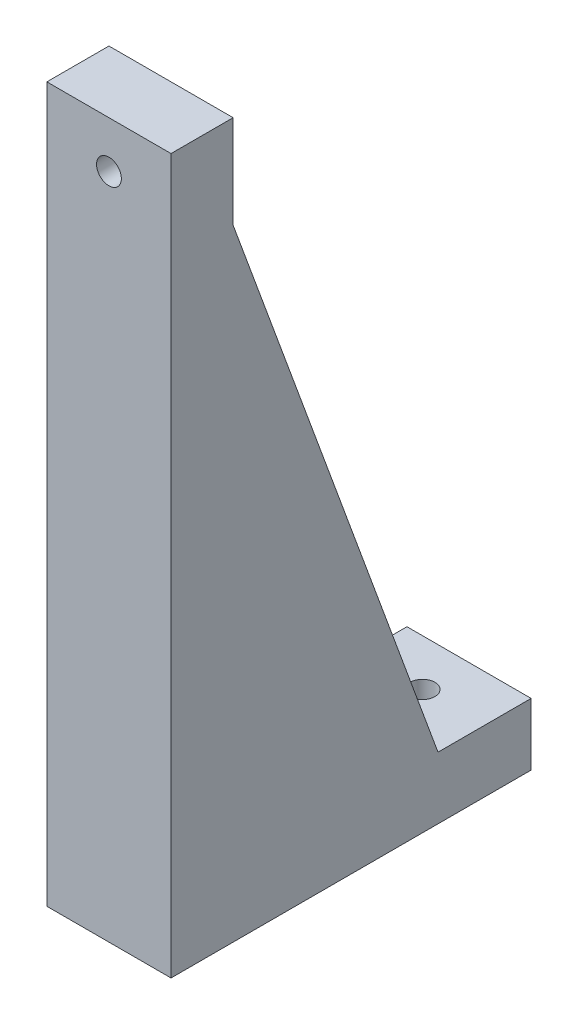
ISO-10303-21;
HEADER;
FILE_DESCRIPTION(('STEP AP214'),'2;1');
FILE_NAME('part.step','',(''),(''),'','','');
FILE_SCHEMA(('AUTOMOTIVE_DESIGN { 1 0 10303 214 1 1 1 1 }'));
ENDSEC;
DATA;
#1=APPLICATION_CONTEXT('core data for automotive mechanical design processes');
#2=APPLICATION_PROTOCOL_DEFINITION('international standard','automotive_design',2000,#1);
#3=PRODUCT_CONTEXT('',#1,'mechanical');
#4=PRODUCT('Part','Part','',(#3));
#5=PRODUCT_RELATED_PRODUCT_CATEGORY('part','',(#4));
#6=PRODUCT_DEFINITION_FORMATION('','',#4);
#7=PRODUCT_DEFINITION_CONTEXT('part definition',#1,'design');
#8=PRODUCT_DEFINITION('design','',#6,#7);
#9=PRODUCT_DEFINITION_SHAPE('','',#8);
#10=(LENGTH_UNIT() NAMED_UNIT(*) SI_UNIT(.MILLI.,.METRE.));
#11=(NAMED_UNIT(*) PLANE_ANGLE_UNIT() SI_UNIT($,.RADIAN.));
#12=(NAMED_UNIT(*) SI_UNIT($,.STERADIAN.) SOLID_ANGLE_UNIT());
#13=UNCERTAINTY_MEASURE_WITH_UNIT(LENGTH_MEASURE(1.E-05),#10,'distance_accuracy_value','');
#14=(GEOMETRIC_REPRESENTATION_CONTEXT(3) GLOBAL_UNCERTAINTY_ASSIGNED_CONTEXT((#13)) GLOBAL_UNIT_ASSIGNED_CONTEXT((#10,
#11,#12)) REPRESENTATION_CONTEXT('',''));
#15=CARTESIAN_POINT('',(0.,0.,0.));
#16=DIRECTION('',(0.,0.,1.));
#17=DIRECTION('',(1.,0.,0.));
#18=AXIS2_PLACEMENT_3D('',#15,#16,#17);
#19=CARTESIAN_POINT('',(25.4,0.,-73.66));
#20=DIRECTION('',(0.,1.,0.));
#21=DIRECTION('',(0.,0.,1.));
#22=AXIS2_PLACEMENT_3D('',#19,#20,#21);
#23=PLANE('',#22);
#24=CARTESIAN_POINT('',(12.7,0.,-64.135));
#25=DIRECTION('',(0.,1.,0.));
#26=DIRECTION('',(0.,0.,1.));
#27=AXIS2_PLACEMENT_3D('',#24,#25,#26);
#28=CIRCLE('',#27,2.53999999999999);
#29=CARTESIAN_POINT('',(12.7,0.,-61.595));
#30=VERTEX_POINT('',#29);
#31=EDGE_CURVE('E161',#30,#30,#28,.T.);
#32=ORIENTED_EDGE('',*,*,#31,.T.);
#33=EDGE_LOOP('',(#32));
#34=FACE_BOUND('',#33,.T.);
#35=DIRECTION('',(0.,0.,-1.));
#36=VECTOR('',#35,1.);
#37=CARTESIAN_POINT('',(0.,0.,-73.66));
#38=LINE('',#37,#36);
#39=CARTESIAN_POINT('',(0.,0.,0.));
#40=VERTEX_POINT('',#39);
#41=CARTESIAN_POINT('',(0.,0.,-73.66));
#42=VERTEX_POINT('',#41);
#43=EDGE_CURVE('E122',#40,#42,#38,.T.);
#44=ORIENTED_EDGE('',*,*,#43,.T.);
#45=DIRECTION('',(-1.,0.,0.));
#46=VECTOR('',#45,1.);
#47=CARTESIAN_POINT('',(25.4,0.,-73.66));
#48=LINE('',#47,#46);
#49=CARTESIAN_POINT('',(25.4,0.,-73.66));
#50=VERTEX_POINT('',#49);
#51=EDGE_CURVE('E11',#50,#42,#48,.T.);
#52=ORIENTED_EDGE('',*,*,#51,.F.);
#53=DIRECTION('',(0.,0.,-1.));
#54=VECTOR('',#53,1.);
#55=CARTESIAN_POINT('',(25.4,0.,-73.66));
#56=LINE('',#55,#54);
#57=CARTESIAN_POINT('',(25.4,0.,0.));
#58=VERTEX_POINT('',#57);
#59=EDGE_CURVE('E135',#58,#50,#56,.T.);
#60=ORIENTED_EDGE('',*,*,#59,.F.);
#61=DIRECTION('',(-1.,0.,0.));
#62=VECTOR('',#61,1.);
#63=CARTESIAN_POINT('',(25.4,0.,0.));
#64=LINE('',#63,#62);
#65=EDGE_CURVE('E118',#58,#40,#64,.T.);
#66=ORIENTED_EDGE('',*,*,#65,.T.);
#67=EDGE_LOOP('',(#44,#52,#60,#66));
#68=FACE_BOUND('',#67,.T.);
#69=ADVANCED_FACE('F32',(#34,#68),#23,.F.);
#70=CARTESIAN_POINT('',(25.4,12.7,-73.66));
#71=DIRECTION('',(0.,0.,1.));
#72=DIRECTION('',(1.,0.,0.));
#73=AXIS2_PLACEMENT_3D('',#70,#71,#72);
#74=PLANE('',#73);
#75=DIRECTION('',(0.,1.,0.));
#76=VECTOR('',#75,1.);
#77=CARTESIAN_POINT('',(0.,12.7,-73.66));
#78=LINE('',#77,#76);
#79=CARTESIAN_POINT('',(0.,12.7,-73.66));
#80=VERTEX_POINT('',#79);
#81=EDGE_CURVE('E125',#42,#80,#78,.T.);
#82=ORIENTED_EDGE('',*,*,#81,.T.);
#83=DIRECTION('',(-1.,0.,0.));
#84=VECTOR('',#83,1.);
#85=CARTESIAN_POINT('',(25.4,12.7,-73.66));
#86=LINE('',#85,#84);
#87=CARTESIAN_POINT('',(25.4,12.7,-73.66));
#88=VERTEX_POINT('',#87);
#89=EDGE_CURVE('E40',#88,#80,#86,.T.);
#90=ORIENTED_EDGE('',*,*,#89,.F.);
#91=DIRECTION('',(0.,1.,0.));
#92=VECTOR('',#91,1.);
#93=CARTESIAN_POINT('',(25.4,12.7,-73.66));
#94=LINE('',#93,#92);
#95=EDGE_CURVE('E88',#50,#88,#94,.T.);
#96=ORIENTED_EDGE('',*,*,#95,.F.);
#97=ORIENTED_EDGE('',*,*,#51,.T.);
#98=EDGE_LOOP('',(#82,#90,#96,#97));
#99=FACE_BOUND('',#98,.T.);
#100=ADVANCED_FACE('F180',(#99),#74,.F.);
#101=CARTESIAN_POINT('',(25.4,12.7,-54.61));
#102=DIRECTION('',(0.,-1.,0.));
#103=DIRECTION('',(0.,0.,-1.));
#104=AXIS2_PLACEMENT_3D('',#101,#102,#103);
#105=PLANE('',#104);
#106=CARTESIAN_POINT('',(12.7,12.7,-64.135));
#107=DIRECTION('',(0.,1.,0.));
#108=DIRECTION('',(0.,0.,1.));
#109=AXIS2_PLACEMENT_3D('',#106,#107,#108);
#110=CIRCLE('',#109,2.53999999999999);
#111=CARTESIAN_POINT('',(12.7,12.7,-61.595));
#112=VERTEX_POINT('',#111);
#113=EDGE_CURVE('E164',#112,#112,#110,.T.);
#114=ORIENTED_EDGE('',*,*,#113,.F.);
#115=EDGE_LOOP('',(#114));
#116=FACE_BOUND('',#115,.T.);
#117=DIRECTION('',(0.,0.,1.));
#118=VECTOR('',#117,1.);
#119=CARTESIAN_POINT('',(0.,12.7,-54.61));
#120=LINE('',#119,#118);
#121=CARTESIAN_POINT('',(0.,12.7,-54.61));
#122=VERTEX_POINT('',#121);
#123=EDGE_CURVE('E128',#80,#122,#120,.T.);
#124=ORIENTED_EDGE('',*,*,#123,.T.);
#125=DIRECTION('',(-1.,0.,0.));
#126=VECTOR('',#125,1.);
#127=CARTESIAN_POINT('',(25.4,12.7,-54.61));
#128=LINE('',#127,#126);
#129=CARTESIAN_POINT('',(25.4,12.7,-54.61));
#130=VERTEX_POINT('',#129);
#131=EDGE_CURVE('E139',#130,#122,#128,.T.);
#132=ORIENTED_EDGE('',*,*,#131,.F.);
#133=DIRECTION('',(0.,0.,1.));
#134=VECTOR('',#133,1.);
#135=CARTESIAN_POINT('',(25.4,12.7,-54.61));
#136=LINE('',#135,#134);
#137=EDGE_CURVE('E147',#88,#130,#136,.T.);
#138=ORIENTED_EDGE('',*,*,#137,.F.);
#139=ORIENTED_EDGE('',*,*,#89,.T.);
#140=EDGE_LOOP('',(#124,#132,#138,#139));
#141=FACE_BOUND('',#140,.T.);
#142=ADVANCED_FACE('F145',(#116,#141),#105,.F.);
#143=CARTESIAN_POINT('',(25.4,127.,-12.7));
#144=DIRECTION('',(0.,-0.344254649158423,0.938876315886608));
#145=DIRECTION('',(0.,-0.938876315886609,-0.344254649158423));
#146=AXIS2_PLACEMENT_3D('',#143,#144,#145);
#147=PLANE('',#146);
#148=DIRECTION('',(0.,0.938876315886609,0.344254649158423));
#149=VECTOR('',#148,1.);
#150=CARTESIAN_POINT('',(0.,127.,-12.7));
#151=LINE('',#150,#149);
#152=CARTESIAN_POINT('',(0.,127.,-12.7));
#153=VERTEX_POINT('',#152);
#154=EDGE_CURVE('E130',#122,#153,#151,.T.);
#155=ORIENTED_EDGE('',*,*,#154,.T.);
#156=DIRECTION('',(-1.,0.,0.));
#157=VECTOR('',#156,1.);
#158=CARTESIAN_POINT('',(25.4,127.,-12.7));
#159=LINE('',#158,#157);
#160=CARTESIAN_POINT('',(25.4,127.,-12.7));
#161=VERTEX_POINT('',#160);
#162=EDGE_CURVE('E113',#161,#153,#159,.T.);
#163=ORIENTED_EDGE('',*,*,#162,.F.);
#164=DIRECTION('',(0.,0.938876315886609,0.344254649158423));
#165=VECTOR('',#164,1.);
#166=CARTESIAN_POINT('',(25.4,127.,-12.7));
#167=LINE('',#166,#165);
#168=EDGE_CURVE('E104',#130,#161,#167,.T.);
#169=ORIENTED_EDGE('',*,*,#168,.F.);
#170=ORIENTED_EDGE('',*,*,#131,.T.);
#171=EDGE_LOOP('',(#155,#163,#169,#170));
#172=FACE_BOUND('',#171,.T.);
#173=ADVANCED_FACE('F153',(#172),#147,.F.);
#174=CARTESIAN_POINT('',(25.4,146.05,-12.7));
#175=DIRECTION('',(0.,0.,1.));
#176=DIRECTION('',(1.,0.,0.));
#177=AXIS2_PLACEMENT_3D('',#174,#175,#176);
#178=PLANE('',#177);
#179=CARTESIAN_POINT('',(12.7,136.525,-12.7));
#180=DIRECTION('',(0.,0.,-1.));
#181=DIRECTION('',(-1.,0.,0.));
#182=AXIS2_PLACEMENT_3D('',#179,#180,#181);
#183=CIRCLE('',#182,2.54);
#184=CARTESIAN_POINT('',(10.16,136.525,-12.7));
#185=VERTEX_POINT('',#184);
#186=EDGE_CURVE('E158',#185,#185,#183,.T.);
#187=ORIENTED_EDGE('',*,*,#186,.F.);
#188=EDGE_LOOP('',(#187));
#189=FACE_BOUND('',#188,.T.);
#190=DIRECTION('',(0.,1.,0.));
#191=VECTOR('',#190,1.);
#192=CARTESIAN_POINT('',(0.,146.05,-12.7));
#193=LINE('',#192,#191);
#194=CARTESIAN_POINT('',(0.,146.05,-12.7));
#195=VERTEX_POINT('',#194);
#196=EDGE_CURVE('E112',#153,#195,#193,.T.);
#197=ORIENTED_EDGE('',*,*,#196,.T.);
#198=DIRECTION('',(-1.,0.,0.));
#199=VECTOR('',#198,1.);
#200=CARTESIAN_POINT('',(25.4,146.05,-12.7));
#201=LINE('',#200,#199);
#202=CARTESIAN_POINT('',(25.4,146.05,-12.7));
#203=VERTEX_POINT('',#202);
#204=EDGE_CURVE('E109',#203,#195,#201,.T.);
#205=ORIENTED_EDGE('',*,*,#204,.F.);
#206=DIRECTION('',(0.,1.,0.));
#207=VECTOR('',#206,1.);
#208=CARTESIAN_POINT('',(25.4,146.05,-12.7));
#209=LINE('',#208,#207);
#210=EDGE_CURVE('E98',#161,#203,#209,.T.);
#211=ORIENTED_EDGE('',*,*,#210,.F.);
#212=ORIENTED_EDGE('',*,*,#162,.T.);
#213=EDGE_LOOP('',(#197,#205,#211,#212));
#214=FACE_BOUND('',#213,.T.);
#215=ADVANCED_FACE('F110',(#189,#214),#178,.F.);
#216=CARTESIAN_POINT('',(25.4,146.05,0.));
#217=DIRECTION('',(0.,-1.,0.));
#218=DIRECTION('',(0.,0.,-1.));
#219=AXIS2_PLACEMENT_3D('',#216,#217,#218);
#220=PLANE('',#219);
#221=DIRECTION('',(0.,0.,1.));
#222=VECTOR('',#221,1.);
#223=CARTESIAN_POINT('',(0.,146.05,0.));
#224=LINE('',#223,#222);
#225=CARTESIAN_POINT('',(0.,146.05,0.));
#226=VERTEX_POINT('',#225);
#227=EDGE_CURVE('E74',#195,#226,#224,.T.);
#228=ORIENTED_EDGE('',*,*,#227,.T.);
#229=DIRECTION('',(-1.,0.,0.));
#230=VECTOR('',#229,1.);
#231=CARTESIAN_POINT('',(25.4,146.05,0.));
#232=LINE('',#231,#230);
#233=CARTESIAN_POINT('',(25.4,146.05,0.));
#234=VERTEX_POINT('',#233);
#235=EDGE_CURVE('E114',#234,#226,#232,.T.);
#236=ORIENTED_EDGE('',*,*,#235,.F.);
#237=DIRECTION('',(0.,0.,1.));
#238=VECTOR('',#237,1.);
#239=CARTESIAN_POINT('',(25.4,146.05,0.));
#240=LINE('',#239,#238);
#241=EDGE_CURVE('E102',#203,#234,#240,.T.);
#242=ORIENTED_EDGE('',*,*,#241,.F.);
#243=ORIENTED_EDGE('',*,*,#204,.T.);
#244=EDGE_LOOP('',(#228,#236,#242,#243));
#245=FACE_BOUND('',#244,.T.);
#246=ADVANCED_FACE('F116',(#245),#220,.F.);
#247=CARTESIAN_POINT('',(25.4,0.,0.));
#248=DIRECTION('',(0.,0.,-1.));
#249=DIRECTION('',(-1.,0.,0.));
#250=AXIS2_PLACEMENT_3D('',#247,#248,#249);
#251=PLANE('',#250);
#252=CARTESIAN_POINT('',(12.7,136.525,0.));
#253=DIRECTION('',(0.,0.,-1.));
#254=DIRECTION('',(-1.,0.,0.));
#255=AXIS2_PLACEMENT_3D('',#252,#253,#254);
#256=CIRCLE('',#255,2.54);
#257=CARTESIAN_POINT('',(10.16,136.525,0.));
#258=VERTEX_POINT('',#257);
#259=EDGE_CURVE('E126',#258,#258,#256,.T.);
#260=ORIENTED_EDGE('',*,*,#259,.T.);
#261=EDGE_LOOP('',(#260));
#262=FACE_BOUND('',#261,.T.);
#263=DIRECTION('',(0.,-1.,0.));
#264=VECTOR('',#263,1.);
#265=CARTESIAN_POINT('',(0.,0.,0.));
#266=LINE('',#265,#264);
#267=EDGE_CURVE('E80',#226,#40,#266,.T.);
#268=ORIENTED_EDGE('',*,*,#267,.T.);
#269=ORIENTED_EDGE('',*,*,#65,.F.);
#270=DIRECTION('',(0.,-1.,0.));
#271=VECTOR('',#270,1.);
#272=CARTESIAN_POINT('',(25.4,0.,0.));
#273=LINE('',#272,#271);
#274=EDGE_CURVE('E48',#234,#58,#273,.T.);
#275=ORIENTED_EDGE('',*,*,#274,.F.);
#276=ORIENTED_EDGE('',*,*,#235,.T.);
#277=EDGE_LOOP('',(#268,#269,#275,#276));
#278=FACE_BOUND('',#277,.T.);
#279=ADVANCED_FACE('F213',(#262,#278),#251,.F.);
#280=CARTESIAN_POINT('',(25.4,0.,0.));
#281=DIRECTION('',(-1.,0.,0.));
#282=DIRECTION('',(0.,0.,1.));
#283=AXIS2_PLACEMENT_3D('',#280,#281,#282);
#284=PLANE('',#283);
#285=ORIENTED_EDGE('',*,*,#59,.T.);
#286=ORIENTED_EDGE('',*,*,#95,.T.);
#287=ORIENTED_EDGE('',*,*,#137,.T.);
#288=ORIENTED_EDGE('',*,*,#168,.T.);
#289=ORIENTED_EDGE('',*,*,#210,.T.);
#290=ORIENTED_EDGE('',*,*,#241,.T.);
#291=ORIENTED_EDGE('',*,*,#274,.T.);
#292=EDGE_LOOP('',(#285,#286,#287,#288,#289,#290,#291));
#293=FACE_BOUND('',#292,.T.);
#294=ADVANCED_FACE('F100',(#293),#284,.F.);
#295=CARTESIAN_POINT('',(0.,0.,0.));
#296=DIRECTION('',(-1.,0.,0.));
#297=DIRECTION('',(0.,0.,1.));
#298=AXIS2_PLACEMENT_3D('',#295,#296,#297);
#299=PLANE('',#298);
#300=ORIENTED_EDGE('',*,*,#43,.F.);
#301=ORIENTED_EDGE('',*,*,#267,.F.);
#302=ORIENTED_EDGE('',*,*,#227,.F.);
#303=ORIENTED_EDGE('',*,*,#196,.F.);
#304=ORIENTED_EDGE('',*,*,#154,.F.);
#305=ORIENTED_EDGE('',*,*,#123,.F.);
#306=ORIENTED_EDGE('',*,*,#81,.F.);
#307=EDGE_LOOP('',(#300,#301,#302,#303,#304,#305,#306));
#308=FACE_BOUND('',#307,.T.);
#309=ADVANCED_FACE('F151',(#308),#299,.T.);
#310=CARTESIAN_POINT('',(12.7,136.525,0.));
#311=DIRECTION('',(0.,0.,-1.));
#312=DIRECTION('',(-1.,0.,0.));
#313=AXIS2_PLACEMENT_3D('',#310,#311,#312);
#314=CYLINDRICAL_SURFACE('',#313,2.54);
#315=ORIENTED_EDGE('',*,*,#259,.F.);
#316=EDGE_LOOP('',(#315));
#317=FACE_BOUND('',#316,.T.);
#318=ORIENTED_EDGE('',*,*,#186,.T.);
#319=EDGE_LOOP('',(#318));
#320=FACE_BOUND('',#319,.T.);
#321=ADVANCED_FACE('F175',(#317,#320),#314,.F.);
#322=CARTESIAN_POINT('',(12.7,0.,-64.135));
#323=DIRECTION('',(0.,1.,0.));
#324=DIRECTION('',(0.,0.,1.));
#325=AXIS2_PLACEMENT_3D('',#322,#323,#324);
#326=CYLINDRICAL_SURFACE('',#325,2.53999999999999);
#327=ORIENTED_EDGE('',*,*,#31,.F.);
#328=EDGE_LOOP('',(#327));
#329=FACE_BOUND('',#328,.T.);
#330=ORIENTED_EDGE('',*,*,#113,.T.);
#331=EDGE_LOOP('',(#330));
#332=FACE_BOUND('',#331,.T.);
#333=ADVANCED_FACE('F172',(#329,#332),#326,.F.);
#334=CLOSED_SHELL('',(#69,#100,#142,#173,#215,#246,#279,#294,#309,#321,#333));
#335=MANIFOLD_SOLID_BREP('B2',#334);
#336=ADVANCED_BREP_SHAPE_REPRESENTATION('',(#18,#335),#14);
#337=SHAPE_DEFINITION_REPRESENTATION(#9,#336);
ENDSEC;
END-ISO-10303-21;
